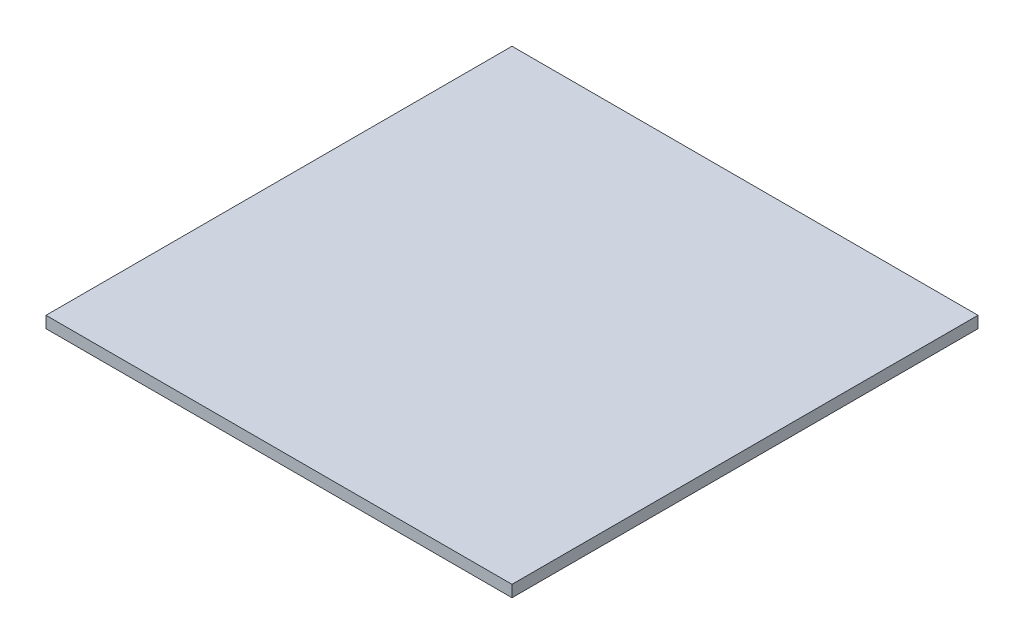
ISO-10303-21;
HEADER;
FILE_DESCRIPTION(('STEP AP214'),'2;1');
FILE_NAME('part.step','',(''),(''),'','','');
FILE_SCHEMA(('AUTOMOTIVE_DESIGN { 1 0 10303 214 1 1 1 1 }'));
ENDSEC;
DATA;
#1=APPLICATION_CONTEXT('core data for automotive mechanical design processes');
#2=APPLICATION_PROTOCOL_DEFINITION('international standard','automotive_design',2000,#1);
#3=PRODUCT_CONTEXT('',#1,'mechanical');
#4=PRODUCT('Part','Part','',(#3));
#5=PRODUCT_RELATED_PRODUCT_CATEGORY('part','',(#4));
#6=PRODUCT_DEFINITION_FORMATION('','',#4);
#7=PRODUCT_DEFINITION_CONTEXT('part definition',#1,'design');
#8=PRODUCT_DEFINITION('design','',#6,#7);
#9=PRODUCT_DEFINITION_SHAPE('','',#8);
#10=(LENGTH_UNIT() NAMED_UNIT(*) SI_UNIT(.MILLI.,.METRE.));
#11=(NAMED_UNIT(*) PLANE_ANGLE_UNIT() SI_UNIT($,.RADIAN.));
#12=(NAMED_UNIT(*) SI_UNIT($,.STERADIAN.) SOLID_ANGLE_UNIT());
#13=UNCERTAINTY_MEASURE_WITH_UNIT(LENGTH_MEASURE(1.E-05),#10,'distance_accuracy_value','');
#14=(GEOMETRIC_REPRESENTATION_CONTEXT(3) GLOBAL_UNCERTAINTY_ASSIGNED_CONTEXT((#13)) GLOBAL_UNIT_ASSIGNED_CONTEXT((#10,
#11,#12)) REPRESENTATION_CONTEXT('',''));
#15=CARTESIAN_POINT('',(0.,0.,0.));
#16=DIRECTION('',(0.,0.,1.));
#17=DIRECTION('',(1.,0.,0.));
#18=AXIS2_PLACEMENT_3D('',#15,#16,#17);
#19=CARTESIAN_POINT('',(40.,2.,-40.));
#20=DIRECTION('',(-1.,0.,0.));
#21=DIRECTION('',(0.,0.,1.));
#22=AXIS2_PLACEMENT_3D('',#19,#20,#21);
#23=PLANE('',#22);
#24=DIRECTION('',(0.,0.,-1.));
#25=VECTOR('',#24,1.);
#26=CARTESIAN_POINT('',(40.,0.,-40.));
#27=LINE('',#26,#25);
#28=CARTESIAN_POINT('',(40.,0.,40.));
#29=VERTEX_POINT('',#28);
#30=CARTESIAN_POINT('',(40.,0.,-40.));
#31=VERTEX_POINT('',#30);
#32=EDGE_CURVE('E98',#29,#31,#27,.T.);
#33=ORIENTED_EDGE('',*,*,#32,.T.);
#34=DIRECTION('',(0.,-1.,0.));
#35=VECTOR('',#34,1.);
#36=CARTESIAN_POINT('',(40.,2.,-40.));
#37=LINE('',#36,#35);
#38=CARTESIAN_POINT('',(40.,2.,-40.));
#39=VERTEX_POINT('',#38);
#40=EDGE_CURVE('E11',#39,#31,#37,.T.);
#41=ORIENTED_EDGE('',*,*,#40,.F.);
#42=DIRECTION('',(0.,0.,-1.));
#43=VECTOR('',#42,1.);
#44=CARTESIAN_POINT('',(40.,2.,-40.));
#45=LINE('',#44,#43);
#46=CARTESIAN_POINT('',(40.,2.,40.));
#47=VERTEX_POINT('',#46);
#48=EDGE_CURVE('E86',#47,#39,#45,.T.);
#49=ORIENTED_EDGE('',*,*,#48,.F.);
#50=DIRECTION('',(0.,-1.,0.));
#51=VECTOR('',#50,1.);
#52=CARTESIAN_POINT('',(40.,2.,40.));
#53=LINE('',#52,#51);
#54=EDGE_CURVE('E94',#47,#29,#53,.T.);
#55=ORIENTED_EDGE('',*,*,#54,.T.);
#56=EDGE_LOOP('',(#33,#41,#49,#55));
#57=FACE_BOUND('',#56,.T.);
#58=ADVANCED_FACE('F35',(#57),#23,.F.);
#59=CARTESIAN_POINT('',(-40.,2.,-40.));
#60=DIRECTION('',(0.,0.,1.));
#61=DIRECTION('',(1.,0.,0.));
#62=AXIS2_PLACEMENT_3D('',#59,#60,#61);
#63=PLANE('',#62);
#64=DIRECTION('',(-1.,0.,0.));
#65=VECTOR('',#64,1.);
#66=CARTESIAN_POINT('',(-40.,0.,-40.));
#67=LINE('',#66,#65);
#68=CARTESIAN_POINT('',(-40.,0.,-40.));
#69=VERTEX_POINT('',#68);
#70=EDGE_CURVE('E90',#31,#69,#67,.T.);
#71=ORIENTED_EDGE('',*,*,#70,.T.);
#72=DIRECTION('',(0.,-1.,0.));
#73=VECTOR('',#72,1.);
#74=CARTESIAN_POINT('',(-40.,2.,-40.));
#75=LINE('',#74,#73);
#76=CARTESIAN_POINT('',(-40.,2.,-40.));
#77=VERTEX_POINT('',#76);
#78=EDGE_CURVE('E43',#77,#69,#75,.T.);
#79=ORIENTED_EDGE('',*,*,#78,.F.);
#80=DIRECTION('',(-1.,0.,0.));
#81=VECTOR('',#80,1.);
#82=CARTESIAN_POINT('',(-40.,2.,-40.));
#83=LINE('',#82,#81);
#84=EDGE_CURVE('E81',#39,#77,#83,.T.);
#85=ORIENTED_EDGE('',*,*,#84,.F.);
#86=ORIENTED_EDGE('',*,*,#40,.T.);
#87=EDGE_LOOP('',(#71,#79,#85,#86));
#88=FACE_BOUND('',#87,.T.);
#89=ADVANCED_FACE('F89',(#88),#63,.F.);
#90=CARTESIAN_POINT('',(-40.,2.,-40.));
#91=DIRECTION('',(1.,0.,0.));
#92=DIRECTION('',(0.,0.,-1.));
#93=AXIS2_PLACEMENT_3D('',#90,#91,#92);
#94=PLANE('',#93);
#95=DIRECTION('',(0.,0.,1.));
#96=VECTOR('',#95,1.);
#97=CARTESIAN_POINT('',(-40.,0.,-40.));
#98=LINE('',#97,#96);
#99=CARTESIAN_POINT('',(-40.,0.,40.));
#100=VERTEX_POINT('',#99);
#101=EDGE_CURVE('E68',#69,#100,#98,.T.);
#102=ORIENTED_EDGE('',*,*,#101,.T.);
#103=DIRECTION('',(0.,-1.,0.));
#104=VECTOR('',#103,1.);
#105=CARTESIAN_POINT('',(-40.,2.,40.));
#106=LINE('',#105,#104);
#107=CARTESIAN_POINT('',(-40.,2.,40.));
#108=VERTEX_POINT('',#107);
#109=EDGE_CURVE('E91',#108,#100,#106,.T.);
#110=ORIENTED_EDGE('',*,*,#109,.F.);
#111=DIRECTION('',(0.,0.,1.));
#112=VECTOR('',#111,1.);
#113=CARTESIAN_POINT('',(-40.,2.,-40.));
#114=LINE('',#113,#112);
#115=EDGE_CURVE('E84',#77,#108,#114,.T.);
#116=ORIENTED_EDGE('',*,*,#115,.F.);
#117=ORIENTED_EDGE('',*,*,#78,.T.);
#118=EDGE_LOOP('',(#102,#110,#116,#117));
#119=FACE_BOUND('',#118,.T.);
#120=ADVANCED_FACE('F92',(#119),#94,.F.);
#121=CARTESIAN_POINT('',(-40.,2.,40.));
#122=DIRECTION('',(0.,0.,-1.));
#123=DIRECTION('',(-1.,0.,0.));
#124=AXIS2_PLACEMENT_3D('',#121,#122,#123);
#125=PLANE('',#124);
#126=DIRECTION('',(1.,0.,0.));
#127=VECTOR('',#126,1.);
#128=CARTESIAN_POINT('',(-40.,0.,40.));
#129=LINE('',#128,#127);
#130=EDGE_CURVE('E74',#100,#29,#129,.T.);
#131=ORIENTED_EDGE('',*,*,#130,.T.);
#132=ORIENTED_EDGE('',*,*,#54,.F.);
#133=DIRECTION('',(1.,0.,0.));
#134=VECTOR('',#133,1.);
#135=CARTESIAN_POINT('',(-40.,2.,40.));
#136=LINE('',#135,#134);
#137=EDGE_CURVE('E51',#108,#47,#136,.T.);
#138=ORIENTED_EDGE('',*,*,#137,.F.);
#139=ORIENTED_EDGE('',*,*,#109,.T.);
#140=EDGE_LOOP('',(#131,#132,#138,#139));
#141=FACE_BOUND('',#140,.T.);
#142=ADVANCED_FACE('F105',(#141),#125,.F.);
#143=CARTESIAN_POINT('',(0.,2.,0.));
#144=DIRECTION('',(0.,1.,0.));
#145=DIRECTION('',(0.,0.,1.));
#146=AXIS2_PLACEMENT_3D('',#143,#144,#145);
#147=PLANE('',#146);
#148=ORIENTED_EDGE('',*,*,#48,.T.);
#149=ORIENTED_EDGE('',*,*,#84,.T.);
#150=ORIENTED_EDGE('',*,*,#115,.T.);
#151=ORIENTED_EDGE('',*,*,#137,.T.);
#152=EDGE_LOOP('',(#148,#149,#150,#151));
#153=FACE_BOUND('',#152,.T.);
#154=ADVANCED_FACE('F82',(#153),#147,.T.);
#155=CARTESIAN_POINT('',(0.,0.,0.));
#156=DIRECTION('',(0.,1.,0.));
#157=DIRECTION('',(0.,0.,1.));
#158=AXIS2_PLACEMENT_3D('',#155,#156,#157);
#159=PLANE('',#158);
#160=ORIENTED_EDGE('',*,*,#32,.F.);
#161=ORIENTED_EDGE('',*,*,#130,.F.);
#162=ORIENTED_EDGE('',*,*,#101,.F.);
#163=ORIENTED_EDGE('',*,*,#70,.F.);
#164=EDGE_LOOP('',(#160,#161,#162,#163));
#165=FACE_BOUND('',#164,.T.);
#166=ADVANCED_FACE('F108',(#165),#159,.F.);
#167=CLOSED_SHELL('',(#58,#89,#120,#142,#154,#166));
#168=MANIFOLD_SOLID_BREP('B2',#167);
#169=ADVANCED_BREP_SHAPE_REPRESENTATION('',(#18,#168),#14);
#170=SHAPE_DEFINITION_REPRESENTATION(#9,#169);
ENDSEC;
END-ISO-10303-21;
